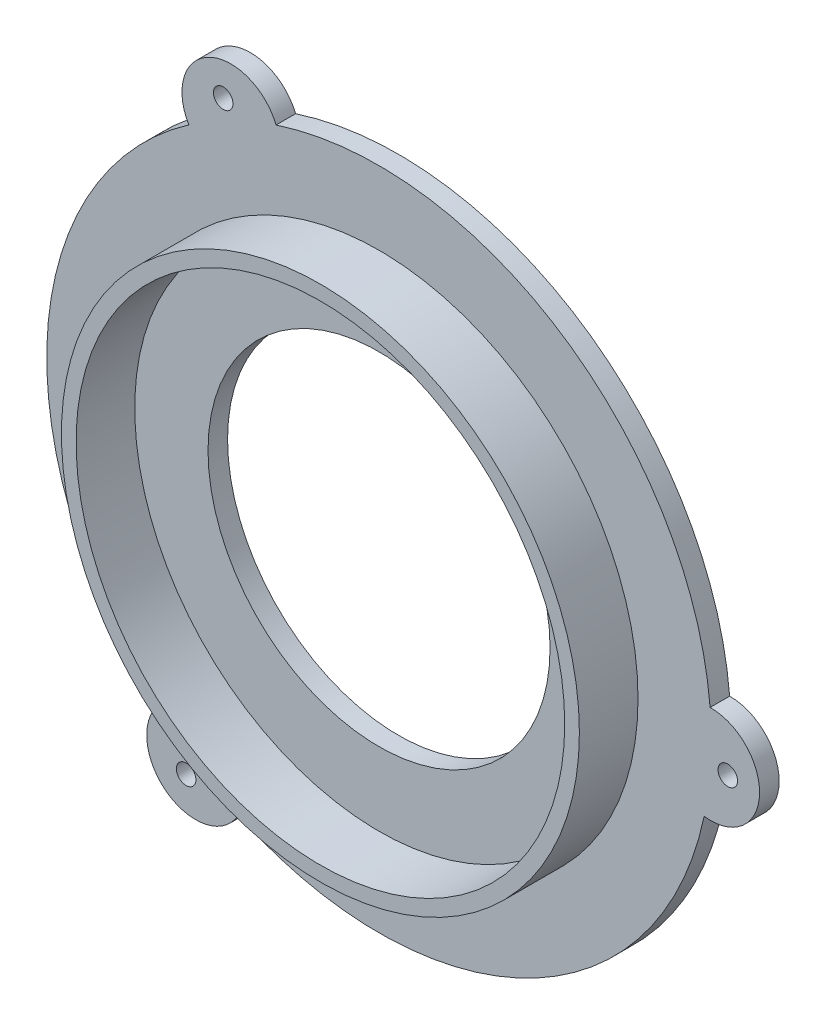
ISO-10303-21;
HEADER;
FILE_DESCRIPTION(('STEP AP214'),'2;1');
FILE_NAME('part.step','',(''),(''),'','','');
FILE_SCHEMA(('AUTOMOTIVE_DESIGN { 1 0 10303 214 1 1 1 1 }'));
ENDSEC;
DATA;
#1=APPLICATION_CONTEXT('core data for automotive mechanical design processes');
#2=APPLICATION_PROTOCOL_DEFINITION('international standard','automotive_design',2000,#1);
#3=PRODUCT_CONTEXT('',#1,'mechanical');
#4=PRODUCT('Part','Part','',(#3));
#5=PRODUCT_RELATED_PRODUCT_CATEGORY('part','',(#4));
#6=PRODUCT_DEFINITION_FORMATION('','',#4);
#7=PRODUCT_DEFINITION_CONTEXT('part definition',#1,'design');
#8=PRODUCT_DEFINITION('design','',#6,#7);
#9=PRODUCT_DEFINITION_SHAPE('','',#8);
#10=(LENGTH_UNIT() NAMED_UNIT(*) SI_UNIT(.MILLI.,.METRE.));
#11=(NAMED_UNIT(*) PLANE_ANGLE_UNIT() SI_UNIT($,.RADIAN.));
#12=(NAMED_UNIT(*) SI_UNIT($,.STERADIAN.) SOLID_ANGLE_UNIT());
#13=UNCERTAINTY_MEASURE_WITH_UNIT(LENGTH_MEASURE(1.E-05),#10,'distance_accuracy_value','');
#14=(GEOMETRIC_REPRESENTATION_CONTEXT(3) GLOBAL_UNCERTAINTY_ASSIGNED_CONTEXT((#13)) GLOBAL_UNIT_ASSIGNED_CONTEXT((#10,
#11,#12)) REPRESENTATION_CONTEXT('',''));
#15=CARTESIAN_POINT('',(0.,0.,0.));
#16=DIRECTION('',(0.,0.,1.));
#17=DIRECTION('',(1.,0.,0.));
#18=AXIS2_PLACEMENT_3D('',#15,#16,#17);
#19=CARTESIAN_POINT('',(-7.58245196639547,15.2153350990803,2.));
#20=DIRECTION('',(0.,0.,1.));
#21=DIRECTION('',(1.,0.,0.));
#22=AXIS2_PLACEMENT_3D('',#19,#20,#21);
#23=PLANE('',#22);
#24=CARTESIAN_POINT('',(0.,0.,2.));
#25=DIRECTION('',(0.,0.,1.));
#26=DIRECTION('',(1.,0.,0.));
#27=AXIS2_PLACEMENT_3D('',#24,#25,#26);
#28=CIRCLE('',#27,26.5);
#29=CARTESIAN_POINT('',(26.5,0.,2.));
#30=VERTEX_POINT('',#29);
#31=EDGE_CURVE('E170',#30,#30,#28,.T.);
#32=ORIENTED_EDGE('',*,*,#31,.F.);
#33=EDGE_LOOP('',(#32));
#34=FACE_BOUND('',#33,.T.);
#35=CARTESIAN_POINT('',(-19.7374503790725,-29.8076425188851,2.));
#36=DIRECTION('',(0.,0.,1.));
#37=DIRECTION('',(1.,0.,0.));
#38=AXIS2_PLACEMENT_3D('',#35,#36,#37);
#39=CIRCLE('',#38,0.999999999999904);
#40=CARTESIAN_POINT('',(-18.7374503790726,-29.8076425188851,2.));
#41=VERTEX_POINT('',#40);
#42=EDGE_CURVE('E155',#41,#41,#39,.T.);
#43=ORIENTED_EDGE('',*,*,#42,.F.);
#44=EDGE_LOOP('',(#43));
#45=FACE_BOUND('',#44,.T.);
#46=CARTESIAN_POINT('',(0.,0.,2.));
#47=DIRECTION('',(0.,0.,1.));
#48=DIRECTION('',(1.,0.,0.));
#49=AXIS2_PLACEMENT_3D('',#46,#47,#48);
#50=CIRCLE('',#49,34.);
#51=CARTESIAN_POINT('',(33.8745970353144,2.91747762546164,2.));
#52=VERTEX_POINT('',#51);
#53=CARTESIAN_POINT('',(-10.5379388841121,32.3257149043098,2.));
#54=VERTEX_POINT('',#53);
#55=EDGE_CURVE('E131',#52,#54,#50,.T.);
#56=ORIENTED_EDGE('',*,*,#55,.T.);
#57=CARTESIAN_POINT('',(-15.1649039327909,30.4306701981606,2.));
#58=DIRECTION('',(0.,0.,1.));
#59=DIRECTION('',(-1.,0.,0.));
#60=AXIS2_PLACEMENT_3D('',#57,#58,#59);
#61=CIRCLE('',#60,5.);
#62=CARTESIAN_POINT('',(-19.4639082562797,27.8775227628125,2.));
#63=VERTEX_POINT('',#62);
#64=EDGE_CURVE('E89',#54,#63,#61,.T.);
#65=ORIENTED_EDGE('',*,*,#64,.T.);
#66=CARTESIAN_POINT('',(0.,0.,2.));
#67=DIRECTION('',(0.,0.,1.));
#68=DIRECTION('',(1.,0.,0.));
#69=AXIS2_PLACEMENT_3D('',#66,#67,#68);
#70=CIRCLE('',#69,34.);
#71=CARTESIAN_POINT('',(-22.7259208605695,-25.2889802293238,2.));
#72=VERTEX_POINT('',#71);
#73=EDGE_CURVE('E102',#63,#72,#70,.T.);
#74=ORIENTED_EDGE('',*,*,#73,.T.);
#75=CARTESIAN_POINT('',(-18.7712814793977,-28.3485271508278,2.));
#76=DIRECTION('',(0.,0.,1.));
#77=DIRECTION('',(-1.,0.,0.));
#78=AXIS2_PLACEMENT_3D('',#75,#76,#77);
#79=CIRCLE('',#78,5.);
#80=CARTESIAN_POINT('',(-14.4106887790347,-30.7950003882741,2.));
#81=VERTEX_POINT('',#80);
#82=EDGE_CURVE('E96',#72,#81,#79,.T.);
#83=ORIENTED_EDGE('',*,*,#82,.T.);
#84=CARTESIAN_POINT('',(0.,0.,2.));
#85=DIRECTION('',(0.,0.,1.));
#86=DIRECTION('',(1.,0.,0.));
#87=AXIS2_PLACEMENT_3D('',#84,#85,#86);
#88=CIRCLE('',#87,34.);
#89=CARTESIAN_POINT('',(33.2638597446816,-7.03673467498605,2.));
#90=VERTEX_POINT('',#89);
#91=EDGE_CURVE('E100',#81,#90,#88,.T.);
#92=ORIENTED_EDGE('',*,*,#91,.T.);
#93=CARTESIAN_POINT('',(33.9361854121886,-2.08214304733285,2.));
#94=DIRECTION('',(0.,0.,1.));
#95=DIRECTION('',(-1.,0.,0.));
#96=AXIS2_PLACEMENT_3D('',#93,#94,#95);
#97=CIRCLE('',#96,5.);
#98=EDGE_CURVE('E51',#90,#52,#97,.T.);
#99=ORIENTED_EDGE('',*,*,#98,.T.);
#100=EDGE_LOOP('',(#56,#65,#74,#83,#92,#99));
#101=FACE_BOUND('',#100,.T.);
#102=CARTESIAN_POINT('',(35.682900837816,-2.18931217476909,2.));
#103=DIRECTION('',(0.,0.,1.));
#104=DIRECTION('',(1.,0.,0.));
#105=AXIS2_PLACEMENT_3D('',#102,#103,#104);
#106=CIRCLE('',#105,0.999999999999998);
#107=CARTESIAN_POINT('',(36.682900837816,-2.18931217476909,2.));
#108=VERTEX_POINT('',#107);
#109=EDGE_CURVE('E124',#108,#108,#106,.T.);
#110=ORIENTED_EDGE('',*,*,#109,.F.);
#111=EDGE_LOOP('',(#110));
#112=FACE_BOUND('',#111,.T.);
#113=CARTESIAN_POINT('',(-15.9454504587434,31.9969546936542,2.));
#114=DIRECTION('',(0.,0.,1.));
#115=DIRECTION('',(1.,0.,0.));
#116=AXIS2_PLACEMENT_3D('',#113,#114,#115);
#117=CIRCLE('',#116,0.999999999999998);
#118=CARTESIAN_POINT('',(-14.9454504587434,31.9969546936542,2.));
#119=VERTEX_POINT('',#118);
#120=EDGE_CURVE('E161',#119,#119,#117,.T.);
#121=ORIENTED_EDGE('',*,*,#120,.F.);
#122=EDGE_LOOP('',(#121));
#123=FACE_BOUND('',#122,.T.);
#124=ADVANCED_FACE('F33',(#34,#45,#101,#112,#123),#23,.T.);
#125=CARTESIAN_POINT('',(-7.58245196639547,15.2153350990803,0.));
#126=DIRECTION('',(0.,0.,1.));
#127=DIRECTION('',(1.,0.,0.));
#128=AXIS2_PLACEMENT_3D('',#125,#126,#127);
#129=PLANE('',#128);
#130=CARTESIAN_POINT('',(0.,0.,0.));
#131=DIRECTION('',(0.,0.,1.));
#132=DIRECTION('',(1.,0.,0.));
#133=AXIS2_PLACEMENT_3D('',#130,#131,#132);
#134=CIRCLE('',#133,17.5);
#135=CARTESIAN_POINT('',(17.5,0.,0.));
#136=VERTEX_POINT('',#135);
#137=EDGE_CURVE('E37',#136,#136,#134,.T.);
#138=ORIENTED_EDGE('',*,*,#137,.T.);
#139=EDGE_LOOP('',(#138));
#140=FACE_BOUND('',#139,.T.);
#141=CARTESIAN_POINT('',(0.,0.,0.));
#142=DIRECTION('',(0.,0.,1.));
#143=DIRECTION('',(1.,0.,0.));
#144=AXIS2_PLACEMENT_3D('',#141,#142,#143);
#145=CIRCLE('',#144,34.);
#146=CARTESIAN_POINT('',(33.8745970353144,2.91747762546164,0.));
#147=VERTEX_POINT('',#146);
#148=CARTESIAN_POINT('',(-10.5379388841121,32.3257149043098,0.));
#149=VERTEX_POINT('',#148);
#150=EDGE_CURVE('E120',#147,#149,#145,.T.);
#151=ORIENTED_EDGE('',*,*,#150,.F.);
#152=CARTESIAN_POINT('',(33.9361854121886,-2.08214304733285,0.));
#153=DIRECTION('',(0.,0.,1.));
#154=DIRECTION('',(-1.,0.,0.));
#155=AXIS2_PLACEMENT_3D('',#152,#153,#154);
#156=CIRCLE('',#155,5.);
#157=CARTESIAN_POINT('',(33.2638597446816,-7.03673467498605,0.));
#158=VERTEX_POINT('',#157);
#159=EDGE_CURVE('E80',#158,#147,#156,.T.);
#160=ORIENTED_EDGE('',*,*,#159,.F.);
#161=CARTESIAN_POINT('',(0.,0.,0.));
#162=DIRECTION('',(0.,0.,1.));
#163=DIRECTION('',(1.,0.,0.));
#164=AXIS2_PLACEMENT_3D('',#161,#162,#163);
#165=CIRCLE('',#164,34.);
#166=CARTESIAN_POINT('',(-14.4106887790347,-30.7950003882741,0.));
#167=VERTEX_POINT('',#166);
#168=EDGE_CURVE('E74',#167,#158,#165,.T.);
#169=ORIENTED_EDGE('',*,*,#168,.F.);
#170=CARTESIAN_POINT('',(-18.7712814793977,-28.3485271508278,0.));
#171=DIRECTION('',(0.,0.,1.));
#172=DIRECTION('',(-1.,0.,0.));
#173=AXIS2_PLACEMENT_3D('',#170,#171,#172);
#174=CIRCLE('',#173,5.);
#175=CARTESIAN_POINT('',(-22.7259208605695,-25.2889802293238,0.));
#176=VERTEX_POINT('',#175);
#177=EDGE_CURVE('E110',#176,#167,#174,.T.);
#178=ORIENTED_EDGE('',*,*,#177,.F.);
#179=CARTESIAN_POINT('',(0.,0.,0.));
#180=DIRECTION('',(0.,0.,1.));
#181=DIRECTION('',(1.,0.,0.));
#182=AXIS2_PLACEMENT_3D('',#179,#180,#181);
#183=CIRCLE('',#182,34.);
#184=CARTESIAN_POINT('',(-19.4639082562797,27.8775227628125,0.));
#185=VERTEX_POINT('',#184);
#186=EDGE_CURVE('E126',#185,#176,#183,.T.);
#187=ORIENTED_EDGE('',*,*,#186,.F.);
#188=CARTESIAN_POINT('',(-15.1649039327909,30.4306701981606,0.));
#189=DIRECTION('',(0.,0.,1.));
#190=DIRECTION('',(-1.,0.,0.));
#191=AXIS2_PLACEMENT_3D('',#188,#189,#190);
#192=CIRCLE('',#191,5.);
#193=EDGE_CURVE('E123',#149,#185,#192,.T.);
#194=ORIENTED_EDGE('',*,*,#193,.F.);
#195=EDGE_LOOP('',(#151,#160,#169,#178,#187,#194));
#196=FACE_BOUND('',#195,.T.);
#197=CARTESIAN_POINT('',(35.682900837816,-2.18931217476909,0.));
#198=DIRECTION('',(0.,0.,1.));
#199=DIRECTION('',(1.,0.,0.));
#200=AXIS2_PLACEMENT_3D('',#197,#198,#199);
#201=CIRCLE('',#200,0.999999999999998);
#202=CARTESIAN_POINT('',(36.682900837816,-2.18931217476909,0.));
#203=VERTEX_POINT('',#202);
#204=EDGE_CURVE('E152',#203,#203,#201,.T.);
#205=ORIENTED_EDGE('',*,*,#204,.T.);
#206=EDGE_LOOP('',(#205));
#207=FACE_BOUND('',#206,.T.);
#208=CARTESIAN_POINT('',(-19.7374503790725,-29.8076425188851,0.));
#209=DIRECTION('',(0.,0.,1.));
#210=DIRECTION('',(1.,0.,0.));
#211=AXIS2_PLACEMENT_3D('',#208,#209,#210);
#212=CIRCLE('',#211,0.999999999999904);
#213=CARTESIAN_POINT('',(-18.7374503790726,-29.8076425188851,0.));
#214=VERTEX_POINT('',#213);
#215=EDGE_CURVE('E158',#214,#214,#212,.T.);
#216=ORIENTED_EDGE('',*,*,#215,.T.);
#217=EDGE_LOOP('',(#216));
#218=FACE_BOUND('',#217,.T.);
#219=CARTESIAN_POINT('',(-15.9454504587434,31.9969546936542,0.));
#220=DIRECTION('',(0.,0.,1.));
#221=DIRECTION('',(1.,0.,0.));
#222=AXIS2_PLACEMENT_3D('',#219,#220,#221);
#223=CIRCLE('',#222,0.999999999999998);
#224=CARTESIAN_POINT('',(-14.9454504587434,31.9969546936542,0.));
#225=VERTEX_POINT('',#224);
#226=EDGE_CURVE('E164',#225,#225,#223,.T.);
#227=ORIENTED_EDGE('',*,*,#226,.T.);
#228=EDGE_LOOP('',(#227));
#229=FACE_BOUND('',#228,.T.);
#230=ADVANCED_FACE('F144',(#140,#196,#207,#218,#229),#129,.F.);
#231=CARTESIAN_POINT('',(0.,0.,2.));
#232=DIRECTION('',(0.,0.,-1.));
#233=DIRECTION('',(-1.,0.,0.));
#234=AXIS2_PLACEMENT_3D('',#231,#232,#233);
#235=CYLINDRICAL_SURFACE('',#234,34.);
#236=ORIENTED_EDGE('',*,*,#150,.T.);
#237=DIRECTION('',(0.,0.,-1.));
#238=VECTOR('',#237,1.);
#239=CARTESIAN_POINT('',(-10.5379388841121,32.3257149043098,2.));
#240=LINE('',#239,#238);
#241=EDGE_CURVE('E43',#54,#149,#240,.T.);
#242=ORIENTED_EDGE('',*,*,#241,.F.);
#243=ORIENTED_EDGE('',*,*,#55,.F.);
#244=DIRECTION('',(0.,0.,-1.));
#245=VECTOR('',#244,1.);
#246=CARTESIAN_POINT('',(33.8745970353144,2.91747762546164,2.));
#247=LINE('',#246,#245);
#248=EDGE_CURVE('E116',#52,#147,#247,.T.);
#249=ORIENTED_EDGE('',*,*,#248,.T.);
#250=EDGE_LOOP('',(#236,#242,#243,#249));
#251=FACE_BOUND('',#250,.T.);
#252=ADVANCED_FACE('F35',(#251),#235,.T.);
#253=CARTESIAN_POINT('',(-15.1649039327909,30.4306701981606,2.));
#254=DIRECTION('',(0.,0.,-1.));
#255=DIRECTION('',(-1.,0.,0.));
#256=AXIS2_PLACEMENT_3D('',#253,#254,#255);
#257=CYLINDRICAL_SURFACE('',#256,5.);
#258=ORIENTED_EDGE('',*,*,#193,.T.);
#259=DIRECTION('',(0.,0.,-1.));
#260=VECTOR('',#259,1.);
#261=CARTESIAN_POINT('',(-19.4639082562797,27.8775227628125,2.));
#262=LINE('',#261,#260);
#263=EDGE_CURVE('E135',#63,#185,#262,.T.);
#264=ORIENTED_EDGE('',*,*,#263,.F.);
#265=ORIENTED_EDGE('',*,*,#64,.F.);
#266=ORIENTED_EDGE('',*,*,#241,.T.);
#267=EDGE_LOOP('',(#258,#264,#265,#266));
#268=FACE_BOUND('',#267,.T.);
#269=ADVANCED_FACE('F139',(#268),#257,.T.);
#270=CARTESIAN_POINT('',(0.,0.,2.));
#271=DIRECTION('',(0.,0.,-1.));
#272=DIRECTION('',(-1.,0.,0.));
#273=AXIS2_PLACEMENT_3D('',#270,#271,#272);
#274=CYLINDRICAL_SURFACE('',#273,34.);
#275=ORIENTED_EDGE('',*,*,#186,.T.);
#276=DIRECTION('',(0.,0.,-1.));
#277=VECTOR('',#276,1.);
#278=CARTESIAN_POINT('',(-22.7259208605695,-25.2889802293238,2.));
#279=LINE('',#278,#277);
#280=EDGE_CURVE('E111',#72,#176,#279,.T.);
#281=ORIENTED_EDGE('',*,*,#280,.F.);
#282=ORIENTED_EDGE('',*,*,#73,.F.);
#283=ORIENTED_EDGE('',*,*,#263,.T.);
#284=EDGE_LOOP('',(#275,#281,#282,#283));
#285=FACE_BOUND('',#284,.T.);
#286=ADVANCED_FACE('F148',(#285),#274,.T.);
#287=CARTESIAN_POINT('',(-18.7712814793977,-28.3485271508278,2.));
#288=DIRECTION('',(0.,0.,-1.));
#289=DIRECTION('',(-1.,0.,0.));
#290=AXIS2_PLACEMENT_3D('',#287,#288,#289);
#291=CYLINDRICAL_SURFACE('',#290,5.);
#292=ORIENTED_EDGE('',*,*,#177,.T.);
#293=DIRECTION('',(0.,0.,-1.));
#294=VECTOR('',#293,1.);
#295=CARTESIAN_POINT('',(-14.4106887790347,-30.7950003882741,2.));
#296=LINE('',#295,#294);
#297=EDGE_CURVE('E107',#81,#167,#296,.T.);
#298=ORIENTED_EDGE('',*,*,#297,.F.);
#299=ORIENTED_EDGE('',*,*,#82,.F.);
#300=ORIENTED_EDGE('',*,*,#280,.T.);
#301=EDGE_LOOP('',(#292,#298,#299,#300));
#302=FACE_BOUND('',#301,.T.);
#303=ADVANCED_FACE('F108',(#302),#291,.T.);
#304=CARTESIAN_POINT('',(0.,0.,2.));
#305=DIRECTION('',(0.,0.,-1.));
#306=DIRECTION('',(-1.,0.,0.));
#307=AXIS2_PLACEMENT_3D('',#304,#305,#306);
#308=CYLINDRICAL_SURFACE('',#307,34.);
#309=ORIENTED_EDGE('',*,*,#168,.T.);
#310=DIRECTION('',(0.,0.,-1.));
#311=VECTOR('',#310,1.);
#312=CARTESIAN_POINT('',(33.2638597446816,-7.03673467498605,2.));
#313=LINE('',#312,#311);
#314=EDGE_CURVE('E112',#90,#158,#313,.T.);
#315=ORIENTED_EDGE('',*,*,#314,.F.);
#316=ORIENTED_EDGE('',*,*,#91,.F.);
#317=ORIENTED_EDGE('',*,*,#297,.T.);
#318=EDGE_LOOP('',(#309,#315,#316,#317));
#319=FACE_BOUND('',#318,.T.);
#320=ADVANCED_FACE('F114',(#319),#308,.T.);
#321=CARTESIAN_POINT('',(33.9361854121886,-2.08214304733285,2.));
#322=DIRECTION('',(0.,0.,-1.));
#323=DIRECTION('',(-1.,0.,0.));
#324=AXIS2_PLACEMENT_3D('',#321,#322,#323);
#325=CYLINDRICAL_SURFACE('',#324,5.);
#326=ORIENTED_EDGE('',*,*,#159,.T.);
#327=ORIENTED_EDGE('',*,*,#248,.F.);
#328=ORIENTED_EDGE('',*,*,#98,.F.);
#329=ORIENTED_EDGE('',*,*,#314,.T.);
#330=EDGE_LOOP('',(#326,#327,#328,#329));
#331=FACE_BOUND('',#330,.T.);
#332=ADVANCED_FACE('F209',(#331),#325,.T.);
#333=CARTESIAN_POINT('',(35.682900837816,-2.18931217476909,2.));
#334=DIRECTION('',(0.,0.,-1.));
#335=DIRECTION('',(-1.,0.,0.));
#336=AXIS2_PLACEMENT_3D('',#333,#334,#335);
#337=CYLINDRICAL_SURFACE('',#336,0.999999999999998);
#338=ORIENTED_EDGE('',*,*,#109,.T.);
#339=EDGE_LOOP('',(#338));
#340=FACE_BOUND('',#339,.T.);
#341=ORIENTED_EDGE('',*,*,#204,.F.);
#342=EDGE_LOOP('',(#341));
#343=FACE_BOUND('',#342,.T.);
#344=ADVANCED_FACE('F206',(#340,#343),#337,.F.);
#345=CARTESIAN_POINT('',(-19.7374503790725,-29.8076425188851,2.));
#346=DIRECTION('',(0.,0.,-1.));
#347=DIRECTION('',(-1.,0.,0.));
#348=AXIS2_PLACEMENT_3D('',#345,#346,#347);
#349=CYLINDRICAL_SURFACE('',#348,0.999999999999904);
#350=ORIENTED_EDGE('',*,*,#42,.T.);
#351=EDGE_LOOP('',(#350));
#352=FACE_BOUND('',#351,.T.);
#353=ORIENTED_EDGE('',*,*,#215,.F.);
#354=EDGE_LOOP('',(#353));
#355=FACE_BOUND('',#354,.T.);
#356=ADVANCED_FACE('F277',(#352,#355),#349,.F.);
#357=CARTESIAN_POINT('',(-15.9454504587434,31.9969546936542,2.));
#358=DIRECTION('',(0.,0.,-1.));
#359=DIRECTION('',(-1.,0.,0.));
#360=AXIS2_PLACEMENT_3D('',#357,#358,#359);
#361=CYLINDRICAL_SURFACE('',#360,0.999999999999998);
#362=ORIENTED_EDGE('',*,*,#120,.T.);
#363=EDGE_LOOP('',(#362));
#364=FACE_BOUND('',#363,.T.);
#365=ORIENTED_EDGE('',*,*,#226,.F.);
#366=EDGE_LOOP('',(#365));
#367=FACE_BOUND('',#366,.T.);
#368=ADVANCED_FACE('F265',(#364,#367),#361,.F.);
#369=CARTESIAN_POINT('',(0.,0.,8.));
#370=DIRECTION('',(0.,0.,1.));
#371=DIRECTION('',(1.,0.,0.));
#372=AXIS2_PLACEMENT_3D('',#369,#370,#371);
#373=PLANE('',#372);
#374=CARTESIAN_POINT('',(0.,0.,8.));
#375=DIRECTION('',(0.,0.,1.));
#376=DIRECTION('',(1.,0.,0.));
#377=AXIS2_PLACEMENT_3D('',#374,#375,#376);
#378=CIRCLE('',#377,26.5);
#379=CARTESIAN_POINT('',(26.5,0.,8.));
#380=VERTEX_POINT('',#379);
#381=EDGE_CURVE('E167',#380,#380,#378,.T.);
#382=ORIENTED_EDGE('',*,*,#381,.T.);
#383=EDGE_LOOP('',(#382));
#384=FACE_BOUND('',#383,.T.);
#385=CARTESIAN_POINT('',(0.,0.,8.));
#386=DIRECTION('',(0.,0.,1.));
#387=DIRECTION('',(1.,0.,0.));
#388=AXIS2_PLACEMENT_3D('',#385,#386,#387);
#389=CIRCLE('',#388,25.);
#390=CARTESIAN_POINT('',(25.,0.,8.));
#391=VERTEX_POINT('',#390);
#392=EDGE_CURVE('E173',#391,#391,#389,.T.);
#393=ORIENTED_EDGE('',*,*,#392,.F.);
#394=EDGE_LOOP('',(#393));
#395=FACE_BOUND('',#394,.T.);
#396=ADVANCED_FACE('F257',(#384,#395),#373,.T.);
#397=CARTESIAN_POINT('',(0.,0.,8.));
#398=DIRECTION('',(0.,0.,-1.));
#399=DIRECTION('',(-1.,0.,0.));
#400=AXIS2_PLACEMENT_3D('',#397,#398,#399);
#401=CYLINDRICAL_SURFACE('',#400,26.5);
#402=ORIENTED_EDGE('',*,*,#381,.F.);
#403=EDGE_LOOP('',(#402));
#404=FACE_BOUND('',#403,.T.);
#405=ORIENTED_EDGE('',*,*,#31,.T.);
#406=EDGE_LOOP('',(#405));
#407=FACE_BOUND('',#406,.T.);
#408=ADVANCED_FACE('F252',(#404,#407),#401,.T.);
#409=CARTESIAN_POINT('',(0.,0.,8.));
#410=DIRECTION('',(0.,0.,-1.));
#411=DIRECTION('',(-1.,0.,0.));
#412=AXIS2_PLACEMENT_3D('',#409,#410,#411);
#413=CYLINDRICAL_SURFACE('',#412,25.);
#414=ORIENTED_EDGE('',*,*,#392,.T.);
#415=EDGE_LOOP('',(#414));
#416=FACE_BOUND('',#415,.T.);
#417=CARTESIAN_POINT('',(0.,0.,2.));
#418=DIRECTION('',(0.,0.,1.));
#419=DIRECTION('',(1.,0.,0.));
#420=AXIS2_PLACEMENT_3D('',#417,#418,#419);
#421=CIRCLE('',#420,25.);
#422=CARTESIAN_POINT('',(25.,0.,2.));
#423=VERTEX_POINT('',#422);
#424=EDGE_CURVE('E11',#423,#423,#421,.F.);
#425=ORIENTED_EDGE('',*,*,#424,.T.);
#426=EDGE_LOOP('',(#425));
#427=FACE_BOUND('',#426,.T.);
#428=ADVANCED_FACE('F193',(#416,#427),#413,.F.);
#429=CARTESIAN_POINT('',(0.,0.,2.));
#430=DIRECTION('',(0.,0.,1.));
#431=DIRECTION('',(1.,0.,0.));
#432=AXIS2_PLACEMENT_3D('',#429,#430,#431);
#433=CIRCLE('',#432,17.5);
#434=CARTESIAN_POINT('',(17.5,0.,2.));
#435=VERTEX_POINT('',#434);
#436=EDGE_CURVE('E178',#435,#435,#433,.T.);
#437=ORIENTED_EDGE('',*,*,#436,.F.);
#438=EDGE_LOOP('',(#437));
#439=FACE_BOUND('',#438,.T.);
#440=ORIENTED_EDGE('',*,*,#424,.F.);
#441=EDGE_LOOP('',(#440));
#442=FACE_BOUND('',#441,.T.);
#443=ADVANCED_FACE('F188',(#439,#442),#23,.T.);
#444=CARTESIAN_POINT('',(0.,0.,-4.));
#445=DIRECTION('',(0.,0.,1.));
#446=DIRECTION('',(1.,0.,0.));
#447=AXIS2_PLACEMENT_3D('',#444,#445,#446);
#448=CYLINDRICAL_SURFACE('',#447,17.5);
#449=ORIENTED_EDGE('',*,*,#436,.T.);
#450=EDGE_LOOP('',(#449));
#451=FACE_BOUND('',#450,.T.);
#452=ORIENTED_EDGE('',*,*,#137,.F.);
#453=EDGE_LOOP('',(#452));
#454=FACE_BOUND('',#453,.T.);
#455=ADVANCED_FACE('F186',(#451,#454),#448,.F.);
#456=CLOSED_SHELL('',(#124,#230,#252,#269,#286,#303,#320,#332,#344,#356,#368,#396,#408,#428,
#443,#455));
#457=MANIFOLD_SOLID_BREP('B2',#456);
#458=ADVANCED_BREP_SHAPE_REPRESENTATION('',(#18,#457),#14);
#459=SHAPE_DEFINITION_REPRESENTATION(#9,#458);
ENDSEC;
END-ISO-10303-21;
